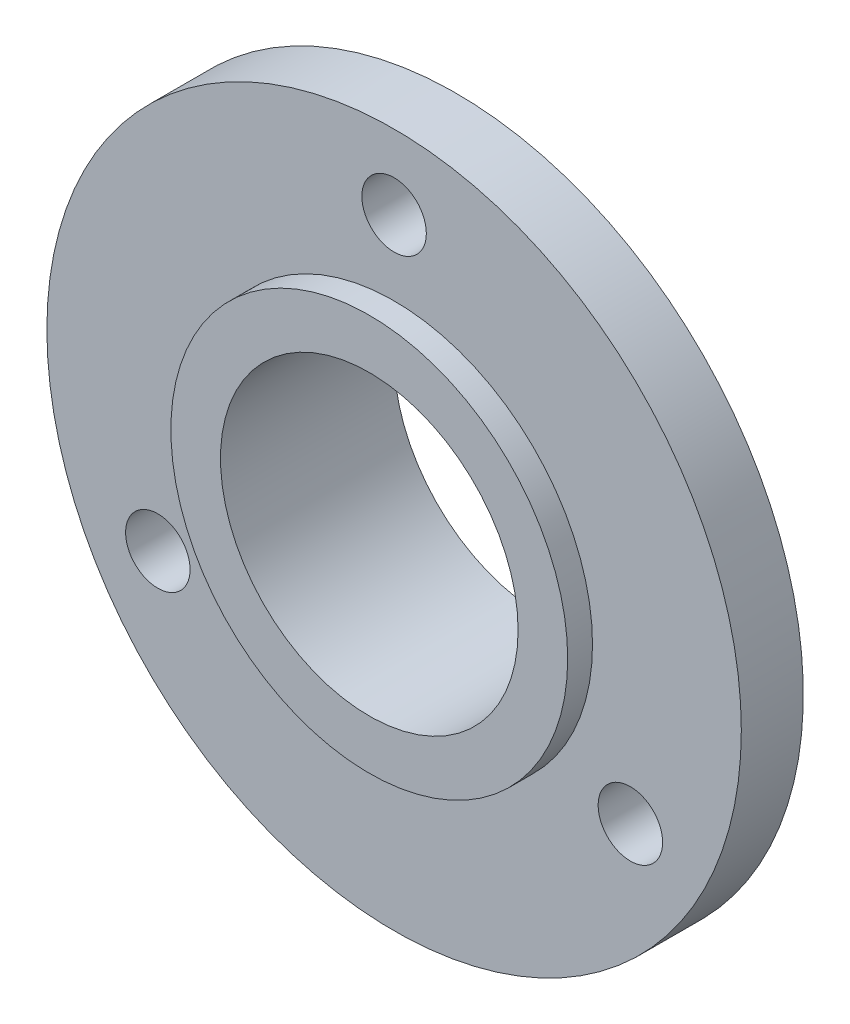
ISO-10303-21;
HEADER;
FILE_DESCRIPTION(('STEP AP214'),'2;1');
FILE_NAME('part.step','',(''),(''),'','','');
FILE_SCHEMA(('AUTOMOTIVE_DESIGN { 1 0 10303 214 1 1 1 1 }'));
ENDSEC;
DATA;
#1=APPLICATION_CONTEXT('core data for automotive mechanical design processes');
#2=APPLICATION_PROTOCOL_DEFINITION('international standard','automotive_design',2000,#1);
#3=PRODUCT_CONTEXT('',#1,'mechanical');
#4=PRODUCT('Part','Part','',(#3));
#5=PRODUCT_RELATED_PRODUCT_CATEGORY('part','',(#4));
#6=PRODUCT_DEFINITION_FORMATION('','',#4);
#7=PRODUCT_DEFINITION_CONTEXT('part definition',#1,'design');
#8=PRODUCT_DEFINITION('design','',#6,#7);
#9=PRODUCT_DEFINITION_SHAPE('','',#8);
#10=(LENGTH_UNIT() NAMED_UNIT(*) SI_UNIT(.MILLI.,.METRE.));
#11=(NAMED_UNIT(*) PLANE_ANGLE_UNIT() SI_UNIT($,.RADIAN.));
#12=(NAMED_UNIT(*) SI_UNIT($,.STERADIAN.) SOLID_ANGLE_UNIT());
#13=UNCERTAINTY_MEASURE_WITH_UNIT(LENGTH_MEASURE(1.E-05),#10,'distance_accuracy_value','');
#14=(GEOMETRIC_REPRESENTATION_CONTEXT(3) GLOBAL_UNCERTAINTY_ASSIGNED_CONTEXT((#13)) GLOBAL_UNIT_ASSIGNED_CONTEXT((#10,
#11,#12)) REPRESENTATION_CONTEXT('',''));
#15=CARTESIAN_POINT('',(0.,0.,0.));
#16=DIRECTION('',(0.,0.,1.));
#17=DIRECTION('',(1.,0.,0.));
#18=AXIS2_PLACEMENT_3D('',#15,#16,#17);
#19=CARTESIAN_POINT('',(0.,0.,7.));
#20=DIRECTION('',(0.,0.,-1.));
#21=DIRECTION('',(-1.,0.,0.));
#22=AXIS2_PLACEMENT_3D('',#19,#20,#21);
#23=CYLINDRICAL_SURFACE('',#22,14.);
#24=CARTESIAN_POINT('',(0.,0.,6.));
#25=DIRECTION('',(0.,0.,1.));
#26=DIRECTION('',(1.,0.,0.));
#27=AXIS2_PLACEMENT_3D('',#24,#25,#26);
#28=CIRCLE('',#27,14.);
#29=CARTESIAN_POINT('',(14.,0.,6.));
#30=VERTEX_POINT('',#29);
#31=EDGE_CURVE('E46',#30,#30,#28,.T.);
#32=ORIENTED_EDGE('',*,*,#31,.F.);
#33=EDGE_LOOP('',(#32));
#34=FACE_BOUND('',#33,.T.);
#35=CARTESIAN_POINT('',(0.,0.,3.5));
#36=DIRECTION('',(0.,0.,-1.));
#37=DIRECTION('',(-1.,0.,0.));
#38=AXIS2_PLACEMENT_3D('',#35,#36,#37);
#39=CIRCLE('',#38,14.);
#40=CARTESIAN_POINT('',(-14.,0.,3.5));
#41=VERTEX_POINT('',#40);
#42=EDGE_CURVE('E51',#41,#41,#39,.T.);
#43=ORIENTED_EDGE('',*,*,#42,.F.);
#44=EDGE_LOOP('',(#43));
#45=FACE_BOUND('',#44,.T.);
#46=ADVANCED_FACE('F34',(#34,#45),#23,.T.);
#47=CARTESIAN_POINT('',(0.,0.,0.));
#48=DIRECTION('',(0.,0.,1.));
#49=DIRECTION('',(1.,0.,0.));
#50=AXIS2_PLACEMENT_3D('',#47,#48,#49);
#51=PLANE('',#50);
#52=CARTESIAN_POINT('',(0.,0.,0.));
#53=DIRECTION('',(0.,0.,1.));
#54=DIRECTION('',(1.,0.,0.));
#55=AXIS2_PLACEMENT_3D('',#52,#53,#54);
#56=CIRCLE('',#55,6.);
#57=CARTESIAN_POINT('',(6.,0.,0.));
#58=VERTEX_POINT('',#57);
#59=EDGE_CURVE('E41',#58,#58,#56,.T.);
#60=ORIENTED_EDGE('',*,*,#59,.T.);
#61=EDGE_LOOP('',(#60));
#62=FACE_BOUND('',#61,.T.);
#63=CARTESIAN_POINT('',(0.,0.,0.));
#64=DIRECTION('',(0.,0.,-1.));
#65=DIRECTION('',(-1.,0.,0.));
#66=AXIS2_PLACEMENT_3D('',#63,#64,#65);
#67=CIRCLE('',#66,8.);
#68=CARTESIAN_POINT('',(-8.,0.,0.));
#69=VERTEX_POINT('',#68);
#70=EDGE_CURVE('E75',#69,#69,#67,.T.);
#71=ORIENTED_EDGE('',*,*,#70,.T.);
#72=EDGE_LOOP('',(#71));
#73=FACE_BOUND('',#72,.T.);
#74=ADVANCED_FACE('F103',(#62,#73),#51,.F.);
#75=CARTESIAN_POINT('',(0.,0.,7.));
#76=DIRECTION('',(0.,0.,1.));
#77=DIRECTION('',(1.,0.,0.));
#78=AXIS2_PLACEMENT_3D('',#75,#76,#77);
#79=PLANE('',#78);
#80=CARTESIAN_POINT('',(0.,0.,7.));
#81=DIRECTION('',(0.,0.,1.));
#82=DIRECTION('',(1.,0.,0.));
#83=AXIS2_PLACEMENT_3D('',#80,#81,#82);
#84=CIRCLE('',#83,6.);
#85=CARTESIAN_POINT('',(6.,0.,7.));
#86=VERTEX_POINT('',#85);
#87=EDGE_CURVE('E11',#86,#86,#84,.T.);
#88=ORIENTED_EDGE('',*,*,#87,.F.);
#89=EDGE_LOOP('',(#88));
#90=FACE_BOUND('',#89,.T.);
#91=CARTESIAN_POINT('',(0.,0.,7.));
#92=DIRECTION('',(0.,0.,1.));
#93=DIRECTION('',(1.,0.,0.));
#94=AXIS2_PLACEMENT_3D('',#91,#92,#93);
#95=CIRCLE('',#94,8.);
#96=CARTESIAN_POINT('',(8.,0.,7.));
#97=VERTEX_POINT('',#96);
#98=EDGE_CURVE('E54',#97,#97,#95,.T.);
#99=ORIENTED_EDGE('',*,*,#98,.T.);
#100=EDGE_LOOP('',(#99));
#101=FACE_BOUND('',#100,.T.);
#102=ADVANCED_FACE('F85',(#90,#101),#79,.T.);
#103=CARTESIAN_POINT('',(0.,0.,7.));
#104=DIRECTION('',(0.,0.,-1.));
#105=DIRECTION('',(-1.,0.,0.));
#106=AXIS2_PLACEMENT_3D('',#103,#104,#105);
#107=CYLINDRICAL_SURFACE('',#106,6.);
#108=ORIENTED_EDGE('',*,*,#87,.T.);
#109=EDGE_LOOP('',(#108));
#110=FACE_BOUND('',#109,.T.);
#111=ORIENTED_EDGE('',*,*,#59,.F.);
#112=EDGE_LOOP('',(#111));
#113=FACE_BOUND('',#112,.T.);
#114=ADVANCED_FACE('F100',(#110,#113),#107,.F.);
#115=CARTESIAN_POINT('',(0.,0.,6.));
#116=DIRECTION('',(0.,0.,1.));
#117=DIRECTION('',(1.,0.,0.));
#118=AXIS2_PLACEMENT_3D('',#115,#116,#117);
#119=PLANE('',#118);
#120=CARTESIAN_POINT('',(-9.52627944162887,-5.49999999999991,6.));
#121=DIRECTION('',(0.,0.,1.));
#122=DIRECTION('',(1.,0.,0.));
#123=AXIS2_PLACEMENT_3D('',#120,#121,#122);
#124=CIRCLE('',#123,1.3);
#125=CARTESIAN_POINT('',(-8.22627944162887,-5.49999999999991,6.));
#126=VERTEX_POINT('',#125);
#127=EDGE_CURVE('E62',#126,#126,#124,.F.);
#128=ORIENTED_EDGE('',*,*,#127,.T.);
#129=EDGE_LOOP('',(#128));
#130=FACE_BOUND('',#129,.T.);
#131=CARTESIAN_POINT('',(9.5262794416288,-5.50000000000004,6.));
#132=DIRECTION('',(0.,0.,1.));
#133=DIRECTION('',(1.,0.,0.));
#134=AXIS2_PLACEMENT_3D('',#131,#132,#133);
#135=CIRCLE('',#134,1.3);
#136=CARTESIAN_POINT('',(10.8262794416288,-5.50000000000004,6.));
#137=VERTEX_POINT('',#136);
#138=EDGE_CURVE('E59',#137,#137,#135,.F.);
#139=ORIENTED_EDGE('',*,*,#138,.T.);
#140=EDGE_LOOP('',(#139));
#141=FACE_BOUND('',#140,.T.);
#142=CARTESIAN_POINT('',(0.,11.,6.));
#143=DIRECTION('',(0.,0.,1.));
#144=DIRECTION('',(1.,0.,0.));
#145=AXIS2_PLACEMENT_3D('',#142,#143,#144);
#146=CIRCLE('',#145,1.3);
#147=CARTESIAN_POINT('',(1.3,11.,6.));
#148=VERTEX_POINT('',#147);
#149=EDGE_CURVE('E58',#148,#148,#146,.F.);
#150=ORIENTED_EDGE('',*,*,#149,.T.);
#151=EDGE_LOOP('',(#150));
#152=FACE_BOUND('',#151,.T.);
#153=CARTESIAN_POINT('',(0.,0.,6.));
#154=DIRECTION('',(0.,0.,1.));
#155=DIRECTION('',(1.,0.,0.));
#156=AXIS2_PLACEMENT_3D('',#153,#154,#155);
#157=CIRCLE('',#156,8.);
#158=CARTESIAN_POINT('',(8.,0.,6.));
#159=VERTEX_POINT('',#158);
#160=EDGE_CURVE('E80',#159,#159,#157,.T.);
#161=ORIENTED_EDGE('',*,*,#160,.F.);
#162=EDGE_LOOP('',(#161));
#163=FACE_BOUND('',#162,.T.);
#164=ORIENTED_EDGE('',*,*,#31,.T.);
#165=EDGE_LOOP('',(#164));
#166=FACE_BOUND('',#165,.T.);
#167=ADVANCED_FACE('F90',(#130,#141,#152,#163,#166),#119,.T.);
#168=CARTESIAN_POINT('',(0.,0.,6.));
#169=DIRECTION('',(0.,0.,1.));
#170=DIRECTION('',(1.,0.,0.));
#171=AXIS2_PLACEMENT_3D('',#168,#169,#170);
#172=CYLINDRICAL_SURFACE('',#171,8.);
#173=ORIENTED_EDGE('',*,*,#160,.T.);
#174=EDGE_LOOP('',(#173));
#175=FACE_BOUND('',#174,.T.);
#176=ORIENTED_EDGE('',*,*,#98,.F.);
#177=EDGE_LOOP('',(#176));
#178=FACE_BOUND('',#177,.T.);
#179=ADVANCED_FACE('F87',(#175,#178),#172,.T.);
#180=CARTESIAN_POINT('',(0.,0.,3.5));
#181=DIRECTION('',(0.,0.,-1.));
#182=DIRECTION('',(-1.,0.,0.));
#183=AXIS2_PLACEMENT_3D('',#180,#181,#182);
#184=PLANE('',#183);
#185=CARTESIAN_POINT('',(-9.52627944162887,-5.49999999999991,3.5));
#186=DIRECTION('',(0.,0.,-1.));
#187=DIRECTION('',(-1.,0.,0.));
#188=AXIS2_PLACEMENT_3D('',#185,#186,#187);
#189=CIRCLE('',#188,1.3);
#190=CARTESIAN_POINT('',(-10.8262794416289,-5.49999999999991,3.5));
#191=VERTEX_POINT('',#190);
#192=EDGE_CURVE('E37',#191,#191,#189,.F.);
#193=ORIENTED_EDGE('',*,*,#192,.T.);
#194=EDGE_LOOP('',(#193));
#195=FACE_BOUND('',#194,.T.);
#196=CARTESIAN_POINT('',(9.5262794416288,-5.50000000000004,3.5));
#197=DIRECTION('',(0.,0.,-1.));
#198=DIRECTION('',(-1.,0.,0.));
#199=AXIS2_PLACEMENT_3D('',#196,#197,#198);
#200=CIRCLE('',#199,1.3);
#201=CARTESIAN_POINT('',(8.2262794416288,-5.50000000000004,3.5));
#202=VERTEX_POINT('',#201);
#203=EDGE_CURVE('E60',#202,#202,#200,.F.);
#204=ORIENTED_EDGE('',*,*,#203,.T.);
#205=EDGE_LOOP('',(#204));
#206=FACE_BOUND('',#205,.T.);
#207=CARTESIAN_POINT('',(0.,11.,3.5));
#208=DIRECTION('',(0.,0.,-1.));
#209=DIRECTION('',(-1.,0.,0.));
#210=AXIS2_PLACEMENT_3D('',#207,#208,#209);
#211=CIRCLE('',#210,1.3);
#212=CARTESIAN_POINT('',(-1.3,11.,3.5));
#213=VERTEX_POINT('',#212);
#214=EDGE_CURVE('E56',#213,#213,#211,.F.);
#215=ORIENTED_EDGE('',*,*,#214,.T.);
#216=EDGE_LOOP('',(#215));
#217=FACE_BOUND('',#216,.T.);
#218=CARTESIAN_POINT('',(0.,0.,3.5));
#219=DIRECTION('',(0.,0.,-1.));
#220=DIRECTION('',(-1.,0.,0.));
#221=AXIS2_PLACEMENT_3D('',#218,#219,#220);
#222=CIRCLE('',#221,8.);
#223=CARTESIAN_POINT('',(-8.,0.,3.5));
#224=VERTEX_POINT('',#223);
#225=EDGE_CURVE('E55',#224,#224,#222,.T.);
#226=ORIENTED_EDGE('',*,*,#225,.F.);
#227=EDGE_LOOP('',(#226));
#228=FACE_BOUND('',#227,.T.);
#229=ORIENTED_EDGE('',*,*,#42,.T.);
#230=EDGE_LOOP('',(#229));
#231=FACE_BOUND('',#230,.T.);
#232=ADVANCED_FACE('F89',(#195,#206,#217,#228,#231),#184,.T.);
#233=CARTESIAN_POINT('',(0.,0.,3.5));
#234=DIRECTION('',(0.,0.,-1.));
#235=DIRECTION('',(-1.,0.,0.));
#236=AXIS2_PLACEMENT_3D('',#233,#234,#235);
#237=CYLINDRICAL_SURFACE('',#236,8.);
#238=ORIENTED_EDGE('',*,*,#225,.T.);
#239=EDGE_LOOP('',(#238));
#240=FACE_BOUND('',#239,.T.);
#241=ORIENTED_EDGE('',*,*,#70,.F.);
#242=EDGE_LOOP('',(#241));
#243=FACE_BOUND('',#242,.T.);
#244=ADVANCED_FACE('F97',(#240,#243),#237,.T.);
#245=CARTESIAN_POINT('',(0.,11.,8.));
#246=DIRECTION('',(0.,0.,-1.));
#247=DIRECTION('',(-1.,0.,0.));
#248=AXIS2_PLACEMENT_3D('',#245,#246,#247);
#249=CYLINDRICAL_SURFACE('',#248,1.3);
#250=ORIENTED_EDGE('',*,*,#149,.F.);
#251=EDGE_LOOP('',(#250));
#252=FACE_BOUND('',#251,.T.);
#253=ORIENTED_EDGE('',*,*,#214,.F.);
#254=EDGE_LOOP('',(#253));
#255=FACE_BOUND('',#254,.T.);
#256=ADVANCED_FACE('F141',(#252,#255),#249,.F.);
#257=CARTESIAN_POINT('',(9.5262794416288,-5.50000000000004,8.));
#258=DIRECTION('',(0.,0.,-1.));
#259=DIRECTION('',(-1.,0.,0.));
#260=AXIS2_PLACEMENT_3D('',#257,#258,#259);
#261=CYLINDRICAL_SURFACE('',#260,1.3);
#262=ORIENTED_EDGE('',*,*,#138,.F.);
#263=EDGE_LOOP('',(#262));
#264=FACE_BOUND('',#263,.T.);
#265=ORIENTED_EDGE('',*,*,#203,.F.);
#266=EDGE_LOOP('',(#265));
#267=FACE_BOUND('',#266,.T.);
#268=ADVANCED_FACE('F155',(#264,#267),#261,.F.);
#269=CARTESIAN_POINT('',(-9.52627944162887,-5.49999999999991,8.));
#270=DIRECTION('',(0.,0.,-1.));
#271=DIRECTION('',(-1.,0.,0.));
#272=AXIS2_PLACEMENT_3D('',#269,#270,#271);
#273=CYLINDRICAL_SURFACE('',#272,1.3);
#274=ORIENTED_EDGE('',*,*,#127,.F.);
#275=EDGE_LOOP('',(#274));
#276=FACE_BOUND('',#275,.T.);
#277=ORIENTED_EDGE('',*,*,#192,.F.);
#278=EDGE_LOOP('',(#277));
#279=FACE_BOUND('',#278,.T.);
#280=ADVANCED_FACE('F160',(#276,#279),#273,.F.);
#281=CLOSED_SHELL('',(#46,#74,#102,#114,#167,#179,#232,#244,#256,#268,#280));
#282=MANIFOLD_SOLID_BREP('B2',#281);
#283=ADVANCED_BREP_SHAPE_REPRESENTATION('',(#18,#282),#14);
#284=SHAPE_DEFINITION_REPRESENTATION(#9,#283);
ENDSEC;
END-ISO-10303-21;
